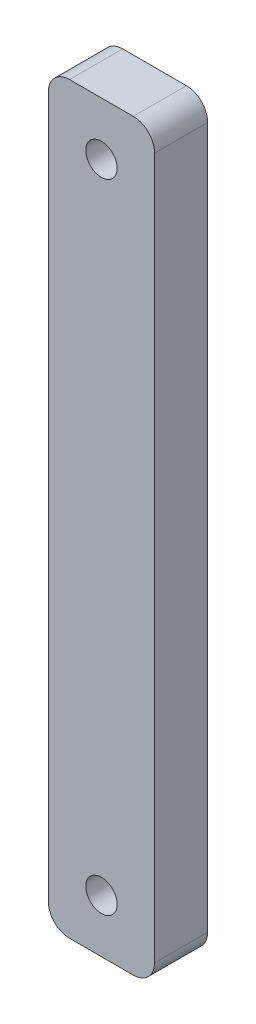
ISO-10303-21;
HEADER;
FILE_DESCRIPTION(('STEP AP214'),'2;1');
FILE_NAME('part.step','',(''),(''),'','','');
FILE_SCHEMA(('AUTOMOTIVE_DESIGN { 1 0 10303 214 1 1 1 1 }'));
ENDSEC;
DATA;
#1=APPLICATION_CONTEXT('core data for automotive mechanical design processes');
#2=APPLICATION_PROTOCOL_DEFINITION('international standard','automotive_design',2000,#1);
#3=PRODUCT_CONTEXT('',#1,'mechanical');
#4=PRODUCT('Part','Part','',(#3));
#5=PRODUCT_RELATED_PRODUCT_CATEGORY('part','',(#4));
#6=PRODUCT_DEFINITION_FORMATION('','',#4);
#7=PRODUCT_DEFINITION_CONTEXT('part definition',#1,'design');
#8=PRODUCT_DEFINITION('design','',#6,#7);
#9=PRODUCT_DEFINITION_SHAPE('','',#8);
#10=(LENGTH_UNIT() NAMED_UNIT(*) SI_UNIT(.MILLI.,.METRE.));
#11=(NAMED_UNIT(*) PLANE_ANGLE_UNIT() SI_UNIT($,.RADIAN.));
#12=(NAMED_UNIT(*) SI_UNIT($,.STERADIAN.) SOLID_ANGLE_UNIT());
#13=UNCERTAINTY_MEASURE_WITH_UNIT(LENGTH_MEASURE(1.E-05),#10,'distance_accuracy_value','');
#14=(GEOMETRIC_REPRESENTATION_CONTEXT(3) GLOBAL_UNCERTAINTY_ASSIGNED_CONTEXT((#13)) GLOBAL_UNIT_ASSIGNED_CONTEXT((#10,
#11,#12)) REPRESENTATION_CONTEXT('',''));
#15=CARTESIAN_POINT('',(0.,0.,0.));
#16=DIRECTION('',(0.,0.,1.));
#17=DIRECTION('',(1.,0.,0.));
#18=AXIS2_PLACEMENT_3D('',#15,#16,#17);
#19=CARTESIAN_POINT('',(0.,0.,5.));
#20=DIRECTION('',(0.,0.,1.));
#21=DIRECTION('',(1.,0.,0.));
#22=AXIS2_PLACEMENT_3D('',#19,#20,#21);
#23=PLANE('',#22);
#24=CARTESIAN_POINT('',(0.,30.,5.));
#25=DIRECTION('',(0.,0.,1.));
#26=DIRECTION('',(1.,0.,0.));
#27=AXIS2_PLACEMENT_3D('',#24,#25,#26);
#28=CIRCLE('',#27,1.475);
#29=CARTESIAN_POINT('',(1.475,30.,5.));
#30=VERTEX_POINT('',#29);
#31=EDGE_CURVE('E127',#30,#30,#28,.T.);
#32=ORIENTED_EDGE('',*,*,#31,.F.);
#33=EDGE_LOOP('',(#32));
#34=FACE_BOUND('',#33,.T.);
#35=DIRECTION('',(1.,0.,0.));
#36=VECTOR('',#35,1.);
#37=CARTESIAN_POINT('',(-5.,-35.,5.));
#38=LINE('',#37,#36);
#39=CARTESIAN_POINT('',(-3.,-35.,5.));
#40=VERTEX_POINT('',#39);
#41=CARTESIAN_POINT('',(3.,-35.,5.));
#42=VERTEX_POINT('',#41);
#43=EDGE_CURVE('E136',#40,#42,#38,.T.);
#44=ORIENTED_EDGE('',*,*,#43,.T.);
#45=CARTESIAN_POINT('',(3.,-33.,5.));
#46=DIRECTION('',(0.,0.,1.));
#47=DIRECTION('',(1.,0.,0.));
#48=AXIS2_PLACEMENT_3D('',#45,#46,#47);
#49=CIRCLE('',#48,2.);
#50=CARTESIAN_POINT('',(5.,-33.,5.));
#51=VERTEX_POINT('',#50);
#52=EDGE_CURVE('E155',#42,#51,#49,.T.);
#53=ORIENTED_EDGE('',*,*,#52,.T.);
#54=DIRECTION('',(0.,1.,0.));
#55=VECTOR('',#54,1.);
#56=CARTESIAN_POINT('',(5.,35.,5.));
#57=LINE('',#56,#55);
#58=CARTESIAN_POINT('',(5.,33.,5.));
#59=VERTEX_POINT('',#58);
#60=EDGE_CURVE('E119',#51,#59,#57,.T.);
#61=ORIENTED_EDGE('',*,*,#60,.T.);
#62=CARTESIAN_POINT('',(3.,33.,5.));
#63=DIRECTION('',(0.,0.,1.));
#64=DIRECTION('',(1.,0.,0.));
#65=AXIS2_PLACEMENT_3D('',#62,#63,#64);
#66=CIRCLE('',#65,2.);
#67=CARTESIAN_POINT('',(3.,35.,5.));
#68=VERTEX_POINT('',#67);
#69=EDGE_CURVE('E150',#59,#68,#66,.T.);
#70=ORIENTED_EDGE('',*,*,#69,.T.);
#71=DIRECTION('',(-1.,0.,0.));
#72=VECTOR('',#71,1.);
#73=CARTESIAN_POINT('',(-5.,35.,5.));
#74=LINE('',#73,#72);
#75=CARTESIAN_POINT('',(-3.,35.,5.));
#76=VERTEX_POINT('',#75);
#77=EDGE_CURVE('E166',#68,#76,#74,.T.);
#78=ORIENTED_EDGE('',*,*,#77,.T.);
#79=CARTESIAN_POINT('',(-3.,33.,5.));
#80=DIRECTION('',(0.,0.,1.));
#81=DIRECTION('',(1.,0.,0.));
#82=AXIS2_PLACEMENT_3D('',#79,#80,#81);
#83=CIRCLE('',#82,2.);
#84=CARTESIAN_POINT('',(-5.,33.,5.));
#85=VERTEX_POINT('',#84);
#86=EDGE_CURVE('E55',#76,#85,#83,.T.);
#87=ORIENTED_EDGE('',*,*,#86,.T.);
#88=DIRECTION('',(0.,-1.,0.));
#89=VECTOR('',#88,1.);
#90=CARTESIAN_POINT('',(-5.,35.,5.));
#91=LINE('',#90,#89);
#92=CARTESIAN_POINT('',(-5.,-33.,5.));
#93=VERTEX_POINT('',#92);
#94=EDGE_CURVE('E174',#85,#93,#91,.T.);
#95=ORIENTED_EDGE('',*,*,#94,.T.);
#96=CARTESIAN_POINT('',(-3.,-33.,5.));
#97=DIRECTION('',(0.,0.,1.));
#98=DIRECTION('',(1.,0.,0.));
#99=AXIS2_PLACEMENT_3D('',#96,#97,#98);
#100=CIRCLE('',#99,2.);
#101=EDGE_CURVE('E153',#93,#40,#100,.T.);
#102=ORIENTED_EDGE('',*,*,#101,.T.);
#103=EDGE_LOOP('',(#44,#53,#61,#70,#78,#87,#95,#102));
#104=FACE_BOUND('',#103,.T.);
#105=CARTESIAN_POINT('',(0.,-30.,5.));
#106=DIRECTION('',(0.,0.,1.));
#107=DIRECTION('',(-1.,0.,0.));
#108=AXIS2_PLACEMENT_3D('',#105,#106,#107);
#109=CIRCLE('',#108,1.475);
#110=CARTESIAN_POINT('',(-1.475,-30.,5.));
#111=VERTEX_POINT('',#110);
#112=EDGE_CURVE('E181',#111,#111,#109,.T.);
#113=ORIENTED_EDGE('',*,*,#112,.F.);
#114=EDGE_LOOP('',(#113));
#115=FACE_BOUND('',#114,.T.);
#116=ADVANCED_FACE('F33',(#34,#104,#115),#23,.T.);
#117=CARTESIAN_POINT('',(0.,0.,0.));
#118=DIRECTION('',(0.,0.,1.));
#119=DIRECTION('',(1.,0.,0.));
#120=AXIS2_PLACEMENT_3D('',#117,#118,#119);
#121=PLANE('',#120);
#122=DIRECTION('',(0.,1.,0.));
#123=VECTOR('',#122,1.);
#124=CARTESIAN_POINT('',(5.,35.,0.));
#125=LINE('',#124,#123);
#126=CARTESIAN_POINT('',(5.,-33.,0.));
#127=VERTEX_POINT('',#126);
#128=CARTESIAN_POINT('',(5.,33.,0.));
#129=VERTEX_POINT('',#128);
#130=EDGE_CURVE('E116',#127,#129,#125,.T.);
#131=ORIENTED_EDGE('',*,*,#130,.F.);
#132=CARTESIAN_POINT('',(3.,-33.,0.));
#133=DIRECTION('',(0.,0.,1.));
#134=DIRECTION('',(1.,0.,0.));
#135=AXIS2_PLACEMENT_3D('',#132,#133,#134);
#136=CIRCLE('',#135,2.);
#137=CARTESIAN_POINT('',(3.,-35.,0.));
#138=VERTEX_POINT('',#137);
#139=EDGE_CURVE('E99',#127,#138,#136,.F.);
#140=ORIENTED_EDGE('',*,*,#139,.T.);
#141=DIRECTION('',(1.,0.,0.));
#142=VECTOR('',#141,1.);
#143=CARTESIAN_POINT('',(-5.,-35.,0.));
#144=LINE('',#143,#142);
#145=CARTESIAN_POINT('',(-3.,-35.,0.));
#146=VERTEX_POINT('',#145);
#147=EDGE_CURVE('E140',#146,#138,#144,.T.);
#148=ORIENTED_EDGE('',*,*,#147,.F.);
#149=CARTESIAN_POINT('',(-3.,-33.,0.));
#150=DIRECTION('',(0.,0.,1.));
#151=DIRECTION('',(1.,0.,0.));
#152=AXIS2_PLACEMENT_3D('',#149,#150,#151);
#153=CIRCLE('',#152,2.);
#154=CARTESIAN_POINT('',(-5.,-33.,0.));
#155=VERTEX_POINT('',#154);
#156=EDGE_CURVE('E110',#146,#155,#153,.F.);
#157=ORIENTED_EDGE('',*,*,#156,.T.);
#158=DIRECTION('',(0.,-1.,0.));
#159=VECTOR('',#158,1.);
#160=CARTESIAN_POINT('',(-5.,35.,0.));
#161=LINE('',#160,#159);
#162=CARTESIAN_POINT('',(-5.,33.,0.));
#163=VERTEX_POINT('',#162);
#164=EDGE_CURVE('E130',#163,#155,#161,.T.);
#165=ORIENTED_EDGE('',*,*,#164,.F.);
#166=CARTESIAN_POINT('',(-3.,33.,0.));
#167=DIRECTION('',(0.,0.,1.));
#168=DIRECTION('',(1.,0.,0.));
#169=AXIS2_PLACEMENT_3D('',#166,#167,#168);
#170=CIRCLE('',#169,2.);
#171=CARTESIAN_POINT('',(-3.,35.,0.));
#172=VERTEX_POINT('',#171);
#173=EDGE_CURVE('E144',#163,#172,#170,.F.);
#174=ORIENTED_EDGE('',*,*,#173,.T.);
#175=DIRECTION('',(-1.,0.,0.));
#176=VECTOR('',#175,1.);
#177=CARTESIAN_POINT('',(-5.,35.,0.));
#178=LINE('',#177,#176);
#179=CARTESIAN_POINT('',(3.,35.,0.));
#180=VERTEX_POINT('',#179);
#181=EDGE_CURVE('E126',#180,#172,#178,.T.);
#182=ORIENTED_EDGE('',*,*,#181,.F.);
#183=CARTESIAN_POINT('',(3.,33.,0.));
#184=DIRECTION('',(0.,0.,1.));
#185=DIRECTION('',(1.,0.,0.));
#186=AXIS2_PLACEMENT_3D('',#183,#184,#185);
#187=CIRCLE('',#186,2.);
#188=EDGE_CURVE('E120',#180,#129,#187,.F.);
#189=ORIENTED_EDGE('',*,*,#188,.T.);
#190=EDGE_LOOP('',(#131,#140,#148,#157,#165,#174,#182,#189));
#191=FACE_BOUND('',#190,.T.);
#192=CARTESIAN_POINT('',(0.,30.,0.));
#193=DIRECTION('',(0.,0.,1.));
#194=DIRECTION('',(1.,0.,0.));
#195=AXIS2_PLACEMENT_3D('',#192,#193,#194);
#196=CIRCLE('',#195,1.475);
#197=CARTESIAN_POINT('',(1.475,30.,0.));
#198=VERTEX_POINT('',#197);
#199=EDGE_CURVE('E133',#198,#198,#196,.T.);
#200=ORIENTED_EDGE('',*,*,#199,.T.);
#201=EDGE_LOOP('',(#200));
#202=FACE_BOUND('',#201,.T.);
#203=CARTESIAN_POINT('',(0.,-30.,0.));
#204=DIRECTION('',(0.,0.,1.));
#205=DIRECTION('',(-1.,0.,0.));
#206=AXIS2_PLACEMENT_3D('',#203,#204,#205);
#207=CIRCLE('',#206,1.475);
#208=CARTESIAN_POINT('',(-1.475,-30.,0.));
#209=VERTEX_POINT('',#208);
#210=EDGE_CURVE('E183',#209,#209,#207,.T.);
#211=ORIENTED_EDGE('',*,*,#210,.T.);
#212=EDGE_LOOP('',(#211));
#213=FACE_BOUND('',#212,.T.);
#214=ADVANCED_FACE('F123',(#191,#202,#213),#121,.F.);
#215=CARTESIAN_POINT('',(5.,35.,5.));
#216=DIRECTION('',(-1.,0.,0.));
#217=DIRECTION('',(0.,0.,1.));
#218=AXIS2_PLACEMENT_3D('',#215,#216,#217);
#219=PLANE('',#218);
#220=ORIENTED_EDGE('',*,*,#60,.F.);
#221=DIRECTION('',(0.,0.,-1.));
#222=VECTOR('',#221,1.);
#223=CARTESIAN_POINT('',(5.,-33.,5.));
#224=LINE('',#223,#222);
#225=EDGE_CURVE('E103',#51,#127,#224,.T.);
#226=ORIENTED_EDGE('',*,*,#225,.T.);
#227=ORIENTED_EDGE('',*,*,#130,.T.);
#228=DIRECTION('',(0.,0.,-1.));
#229=VECTOR('',#228,1.);
#230=CARTESIAN_POINT('',(5.,33.,5.));
#231=LINE('',#230,#229);
#232=EDGE_CURVE('E121',#129,#59,#231,.F.);
#233=ORIENTED_EDGE('',*,*,#232,.T.);
#234=EDGE_LOOP('',(#220,#226,#227,#233));
#235=FACE_BOUND('',#234,.T.);
#236=ADVANCED_FACE('F115',(#235),#219,.F.);
#237=CARTESIAN_POINT('',(-5.,35.,5.));
#238=DIRECTION('',(0.,-1.,0.));
#239=DIRECTION('',(0.,0.,-1.));
#240=AXIS2_PLACEMENT_3D('',#237,#238,#239);
#241=PLANE('',#240);
#242=ORIENTED_EDGE('',*,*,#181,.T.);
#243=DIRECTION('',(0.,0.,-1.));
#244=VECTOR('',#243,1.);
#245=CARTESIAN_POINT('',(-3.,35.,5.));
#246=LINE('',#245,#244);
#247=EDGE_CURVE('E11',#172,#76,#246,.F.);
#248=ORIENTED_EDGE('',*,*,#247,.T.);
#249=ORIENTED_EDGE('',*,*,#77,.F.);
#250=DIRECTION('',(0.,0.,-1.));
#251=VECTOR('',#250,1.);
#252=CARTESIAN_POINT('',(3.,35.,5.));
#253=LINE('',#252,#251);
#254=EDGE_CURVE('E41',#68,#180,#253,.T.);
#255=ORIENTED_EDGE('',*,*,#254,.T.);
#256=EDGE_LOOP('',(#242,#248,#249,#255));
#257=FACE_BOUND('',#256,.T.);
#258=ADVANCED_FACE('F164',(#257),#241,.F.);
#259=CARTESIAN_POINT('',(-5.,35.,5.));
#260=DIRECTION('',(1.,0.,0.));
#261=DIRECTION('',(0.,0.,-1.));
#262=AXIS2_PLACEMENT_3D('',#259,#260,#261);
#263=PLANE('',#262);
#264=ORIENTED_EDGE('',*,*,#164,.T.);
#265=DIRECTION('',(0.,0.,-1.));
#266=VECTOR('',#265,1.);
#267=CARTESIAN_POINT('',(-5.,-33.,5.));
#268=LINE('',#267,#266);
#269=EDGE_CURVE('E48',#155,#93,#268,.F.);
#270=ORIENTED_EDGE('',*,*,#269,.T.);
#271=ORIENTED_EDGE('',*,*,#94,.F.);
#272=DIRECTION('',(0.,0.,-1.));
#273=VECTOR('',#272,1.);
#274=CARTESIAN_POINT('',(-5.,33.,5.));
#275=LINE('',#274,#273);
#276=EDGE_CURVE('E157',#85,#163,#275,.T.);
#277=ORIENTED_EDGE('',*,*,#276,.T.);
#278=EDGE_LOOP('',(#264,#270,#271,#277));
#279=FACE_BOUND('',#278,.T.);
#280=ADVANCED_FACE('F173',(#279),#263,.F.);
#281=CARTESIAN_POINT('',(-5.,-35.,5.));
#282=DIRECTION('',(0.,1.,0.));
#283=DIRECTION('',(0.,0.,1.));
#284=AXIS2_PLACEMENT_3D('',#281,#282,#283);
#285=PLANE('',#284);
#286=ORIENTED_EDGE('',*,*,#147,.T.);
#287=DIRECTION('',(0.,0.,-1.));
#288=VECTOR('',#287,1.);
#289=CARTESIAN_POINT('',(3.,-35.,5.));
#290=LINE('',#289,#288);
#291=EDGE_CURVE('E104',#138,#42,#290,.F.);
#292=ORIENTED_EDGE('',*,*,#291,.T.);
#293=ORIENTED_EDGE('',*,*,#43,.F.);
#294=DIRECTION('',(0.,0.,-1.));
#295=VECTOR('',#294,1.);
#296=CARTESIAN_POINT('',(-3.,-35.,5.));
#297=LINE('',#296,#295);
#298=EDGE_CURVE('E109',#40,#146,#297,.T.);
#299=ORIENTED_EDGE('',*,*,#298,.T.);
#300=EDGE_LOOP('',(#286,#292,#293,#299));
#301=FACE_BOUND('',#300,.T.);
#302=ADVANCED_FACE('F204',(#301),#285,.F.);
#303=CARTESIAN_POINT('',(0.,30.,5.));
#304=DIRECTION('',(0.,0.,-1.));
#305=DIRECTION('',(-1.,0.,0.));
#306=AXIS2_PLACEMENT_3D('',#303,#304,#305);
#307=CYLINDRICAL_SURFACE('',#306,1.475);
#308=ORIENTED_EDGE('',*,*,#31,.T.);
#309=EDGE_LOOP('',(#308));
#310=FACE_BOUND('',#309,.T.);
#311=ORIENTED_EDGE('',*,*,#199,.F.);
#312=EDGE_LOOP('',(#311));
#313=FACE_BOUND('',#312,.T.);
#314=ADVANCED_FACE('F201',(#310,#313),#307,.F.);
#315=CARTESIAN_POINT('',(0.,-30.,5.));
#316=DIRECTION('',(0.,0.,-1.));
#317=DIRECTION('',(-1.,0.,0.));
#318=AXIS2_PLACEMENT_3D('',#315,#316,#317);
#319=CYLINDRICAL_SURFACE('',#318,1.475);
#320=ORIENTED_EDGE('',*,*,#112,.T.);
#321=EDGE_LOOP('',(#320));
#322=FACE_BOUND('',#321,.T.);
#323=ORIENTED_EDGE('',*,*,#210,.F.);
#324=EDGE_LOOP('',(#323));
#325=FACE_BOUND('',#324,.T.);
#326=ADVANCED_FACE('F189',(#322,#325),#319,.F.);
#327=CARTESIAN_POINT('',(3.,-33.,5.));
#328=DIRECTION('',(0.,0.,-1.));
#329=DIRECTION('',(-1.,0.,0.));
#330=AXIS2_PLACEMENT_3D('',#327,#328,#329);
#331=CYLINDRICAL_SURFACE('',#330,2.);
#332=ORIENTED_EDGE('',*,*,#52,.F.);
#333=ORIENTED_EDGE('',*,*,#291,.F.);
#334=ORIENTED_EDGE('',*,*,#139,.F.);
#335=ORIENTED_EDGE('',*,*,#225,.F.);
#336=EDGE_LOOP('',(#332,#333,#334,#335));
#337=FACE_BOUND('',#336,.T.);
#338=ADVANCED_FACE('F102',(#337),#331,.T.);
#339=CARTESIAN_POINT('',(-3.,-33.,5.));
#340=DIRECTION('',(0.,0.,-1.));
#341=DIRECTION('',(-1.,0.,0.));
#342=AXIS2_PLACEMENT_3D('',#339,#340,#341);
#343=CYLINDRICAL_SURFACE('',#342,2.);
#344=ORIENTED_EDGE('',*,*,#101,.F.);
#345=ORIENTED_EDGE('',*,*,#269,.F.);
#346=ORIENTED_EDGE('',*,*,#156,.F.);
#347=ORIENTED_EDGE('',*,*,#298,.F.);
#348=EDGE_LOOP('',(#344,#345,#346,#347));
#349=FACE_BOUND('',#348,.T.);
#350=ADVANCED_FACE('F216',(#349),#343,.T.);
#351=CARTESIAN_POINT('',(-3.,33.,5.));
#352=DIRECTION('',(0.,0.,-1.));
#353=DIRECTION('',(-1.,0.,0.));
#354=AXIS2_PLACEMENT_3D('',#351,#352,#353);
#355=CYLINDRICAL_SURFACE('',#354,2.);
#356=ORIENTED_EDGE('',*,*,#86,.F.);
#357=ORIENTED_EDGE('',*,*,#247,.F.);
#358=ORIENTED_EDGE('',*,*,#173,.F.);
#359=ORIENTED_EDGE('',*,*,#276,.F.);
#360=EDGE_LOOP('',(#356,#357,#358,#359));
#361=FACE_BOUND('',#360,.T.);
#362=ADVANCED_FACE('F172',(#361),#355,.T.);
#363=CARTESIAN_POINT('',(3.,33.,5.));
#364=DIRECTION('',(0.,0.,-1.));
#365=DIRECTION('',(-1.,0.,0.));
#366=AXIS2_PLACEMENT_3D('',#363,#364,#365);
#367=CYLINDRICAL_SURFACE('',#366,2.);
#368=ORIENTED_EDGE('',*,*,#69,.F.);
#369=ORIENTED_EDGE('',*,*,#232,.F.);
#370=ORIENTED_EDGE('',*,*,#188,.F.);
#371=ORIENTED_EDGE('',*,*,#254,.F.);
#372=EDGE_LOOP('',(#368,#369,#370,#371));
#373=FACE_BOUND('',#372,.T.);
#374=ADVANCED_FACE('F35',(#373),#367,.T.);
#375=CLOSED_SHELL('',(#116,#214,#236,#258,#280,#302,#314,#326,#338,#350,#362,#374));
#376=MANIFOLD_SOLID_BREP('B2',#375);
#377=ADVANCED_BREP_SHAPE_REPRESENTATION('',(#18,#376),#14);
#378=SHAPE_DEFINITION_REPRESENTATION(#9,#377);
ENDSEC;
END-ISO-10303-21;
